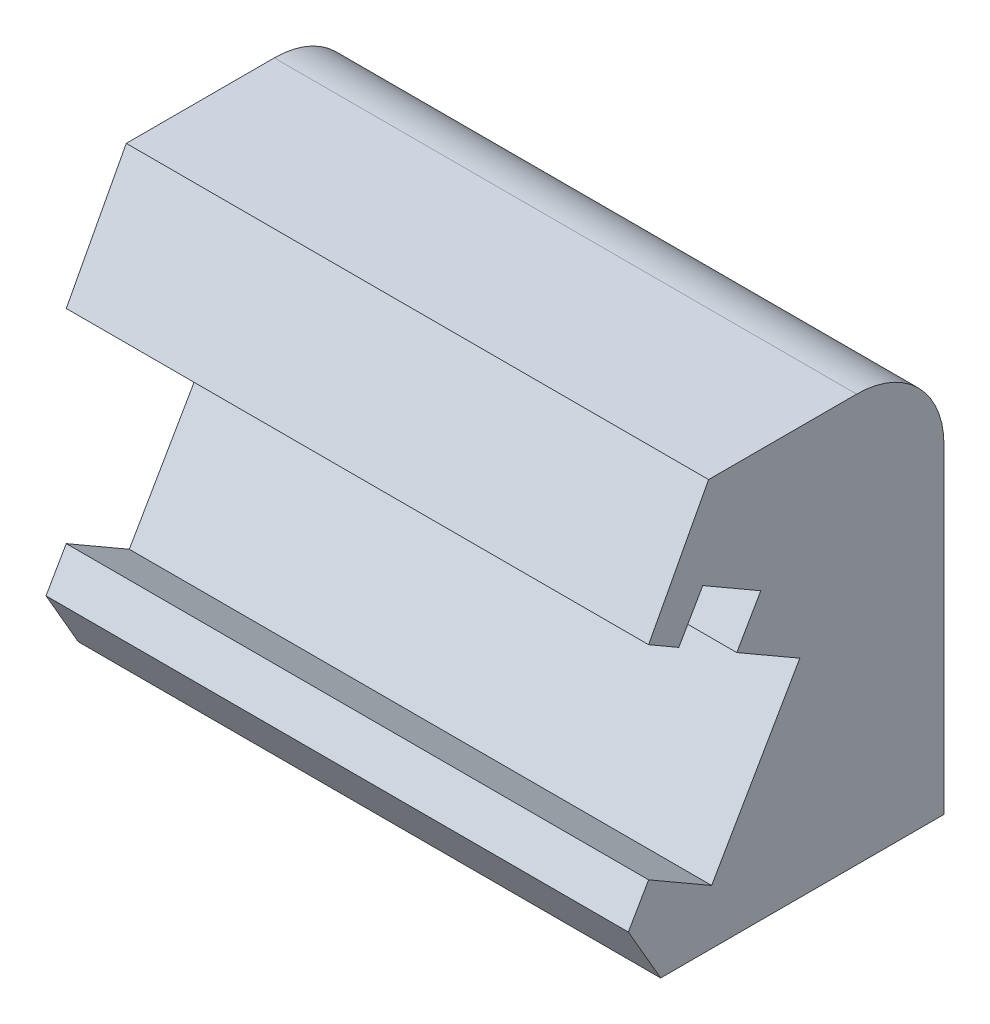
ISO-10303-21;
HEADER;
FILE_DESCRIPTION(('STEP AP214'),'2;1');
FILE_NAME('part.step','',(''),(''),'','','');
FILE_SCHEMA(('AUTOMOTIVE_DESIGN { 1 0 10303 214 1 1 1 1 }'));
ENDSEC;
DATA;
#1=APPLICATION_CONTEXT('core data for automotive mechanical design processes');
#2=APPLICATION_PROTOCOL_DEFINITION('international standard','automotive_design',2000,#1);
#3=PRODUCT_CONTEXT('',#1,'mechanical');
#4=PRODUCT('Part','Part','',(#3));
#5=PRODUCT_RELATED_PRODUCT_CATEGORY('part','',(#4));
#6=PRODUCT_DEFINITION_FORMATION('','',#4);
#7=PRODUCT_DEFINITION_CONTEXT('part definition',#1,'design');
#8=PRODUCT_DEFINITION('design','',#6,#7);
#9=PRODUCT_DEFINITION_SHAPE('','',#8);
#10=(LENGTH_UNIT() NAMED_UNIT(*) SI_UNIT(.MILLI.,.METRE.));
#11=(NAMED_UNIT(*) PLANE_ANGLE_UNIT() SI_UNIT($,.RADIAN.));
#12=(NAMED_UNIT(*) SI_UNIT($,.STERADIAN.) SOLID_ANGLE_UNIT());
#13=UNCERTAINTY_MEASURE_WITH_UNIT(LENGTH_MEASURE(1.E-05),#10,'distance_accuracy_value','');
#14=(GEOMETRIC_REPRESENTATION_CONTEXT(3) GLOBAL_UNCERTAINTY_ASSIGNED_CONTEXT((#13)) GLOBAL_UNIT_ASSIGNED_CONTEXT((#10,
#11,#12)) REPRESENTATION_CONTEXT('',''));
#15=CARTESIAN_POINT('',(0.,0.,0.));
#16=DIRECTION('',(0.,0.,1.));
#17=DIRECTION('',(1.,0.,0.));
#18=AXIS2_PLACEMENT_3D('',#15,#16,#17);
#19=CARTESIAN_POINT('',(-41.8,9.38,-6.7465234882107));
#20=DIRECTION('',(0.,-0.499999999999997,0.86602540378444));
#21=DIRECTION('',(0.,-0.86602540378444,-0.499999999999997));
#22=AXIS2_PLACEMENT_3D('',#19,#20,#21);
#23=PLANE('',#22);
#24=DIRECTION('',(0.,-0.86602540378444,-0.499999999999997));
#25=VECTOR('',#24,1.);
#26=CARTESIAN_POINT('',(-21.8,9.38,-6.7465234882107));
#27=LINE('',#26,#25);
#28=CARTESIAN_POINT('',(-21.8,11.3021331848201,-5.63677937653651));
#29=VERTEX_POINT('',#28);
#30=CARTESIAN_POINT('',(-21.8,9.38,-6.7465234882107));
#31=VERTEX_POINT('',#30);
#32=EDGE_CURVE('E221',#29,#31,#27,.T.);
#33=ORIENTED_EDGE('',*,*,#32,.F.);
#34=DIRECTION('',(-1.,0.,0.));
#35=VECTOR('',#34,1.);
#36=CARTESIAN_POINT('',(-21.8,11.3021331848201,-5.63677937653651));
#37=LINE('',#36,#35);
#38=CARTESIAN_POINT('',(-41.8,11.3021331848201,-5.63677937653651));
#39=VERTEX_POINT('',#38);
#40=EDGE_CURVE('E202',#29,#39,#37,.T.);
#41=ORIENTED_EDGE('',*,*,#40,.T.);
#42=DIRECTION('',(0.,-0.86602540378444,-0.499999999999997));
#43=VECTOR('',#42,1.);
#44=CARTESIAN_POINT('',(-41.8,9.38,-6.7465234882107));
#45=LINE('',#44,#43);
#46=CARTESIAN_POINT('',(-41.8,9.38,-6.7465234882107));
#47=VERTEX_POINT('',#46);
#48=EDGE_CURVE('E57',#39,#47,#45,.T.);
#49=ORIENTED_EDGE('',*,*,#48,.T.);
#50=DIRECTION('',(1.,0.,0.));
#51=VECTOR('',#50,1.);
#52=CARTESIAN_POINT('',(-41.8,9.38,-6.7465234882107));
#53=LINE('',#52,#51);
#54=EDGE_CURVE('E11',#47,#31,#53,.T.);
#55=ORIENTED_EDGE('',*,*,#54,.T.);
#56=EDGE_LOOP('',(#33,#41,#49,#55));
#57=FACE_BOUND('',#56,.T.);
#58=ADVANCED_FACE('F33',(#57),#23,.T.);
#59=CARTESIAN_POINT('',(-41.8,14.6021331848202,-3.73152348821072));
#60=DIRECTION('',(0.,0.4689519731062,0.88322366754962));
#61=DIRECTION('',(0.,-0.88322366754962,0.4689519731062));
#62=AXIS2_PLACEMENT_3D('',#59,#60,#61);
#63=PLANE('',#62);
#64=DIRECTION('',(0.,-0.88322366754962,0.4689519731062));
#65=VECTOR('',#64,1.);
#66=CARTESIAN_POINT('',(-41.8,14.6021331848202,-3.73152348821072));
#67=LINE('',#66,#65);
#68=CARTESIAN_POINT('',(-41.8,23.3813764402635,-8.3929061008864));
#69=VERTEX_POINT('',#68);
#70=CARTESIAN_POINT('',(-41.8,19.5005359644257,-6.33235466264919));
#71=VERTEX_POINT('',#70);
#72=EDGE_CURVE('E235',#69,#71,#67,.T.);
#73=ORIENTED_EDGE('',*,*,#72,.T.);
#74=DIRECTION('',(-1.,0.,0.));
#75=VECTOR('',#74,1.);
#76=CARTESIAN_POINT('',(-21.8,19.5005359644257,-6.3323546626492));
#77=LINE('',#76,#75);
#78=CARTESIAN_POINT('',(-21.8,19.5005359644257,-6.3323546626492));
#79=VERTEX_POINT('',#78);
#80=EDGE_CURVE('E204',#79,#71,#77,.T.);
#81=ORIENTED_EDGE('',*,*,#80,.F.);
#82=DIRECTION('',(0.,-0.88322366754962,0.4689519731062));
#83=VECTOR('',#82,1.);
#84=CARTESIAN_POINT('',(-21.8,14.6021331848202,-3.73152348821072));
#85=LINE('',#84,#83);
#86=CARTESIAN_POINT('',(-21.8,23.3813764402635,-8.3929061008864));
#87=VERTEX_POINT('',#86);
#88=EDGE_CURVE('E218',#87,#79,#85,.T.);
#89=ORIENTED_EDGE('',*,*,#88,.F.);
#90=DIRECTION('',(1.,0.,0.));
#91=VECTOR('',#90,1.);
#92=CARTESIAN_POINT('',(-41.8,23.3813764402635,-8.3929061008864));
#93=LINE('',#92,#91);
#94=EDGE_CURVE('E42',#69,#87,#93,.T.);
#95=ORIENTED_EDGE('',*,*,#94,.F.);
#96=EDGE_LOOP('',(#73,#81,#89,#95));
#97=FACE_BOUND('',#96,.T.);
#98=ADVANCED_FACE('F266',(#97),#63,.T.);
#99=CARTESIAN_POINT('',(-41.8,20.3813764402635,-13.4766045576977));
#100=DIRECTION('',(-1.,0.,0.));
#101=DIRECTION('',(0.,0.,1.));
#102=AXIS2_PLACEMENT_3D('',#99,#100,#101);
#103=PLANE('',#102);
#104=DIRECTION('',(0.,-0.866025403784438,0.500000000000001));
#105=VECTOR('',#104,1.);
#106=CARTESIAN_POINT('',(-41.8,18.9021282035334,-7.36882730815819));
#107=LINE('',#106,#105);
#108=CARTESIAN_POINT('',(-41.8,20.3288558380304,-8.19254889199526));
#109=VERTEX_POINT('',#108);
#110=CARTESIAN_POINT('',(-41.8,18.9021282035334,-7.36882730815819));
#111=VERTEX_POINT('',#110);
#112=EDGE_CURVE('E152',#109,#111,#107,.T.);
#113=ORIENTED_EDGE('',*,*,#112,.T.);
#114=DIRECTION('',(0.,0.499999999999999,0.866025403784439));
#115=VECTOR('',#114,1.);
#116=CARTESIAN_POINT('',(-41.8,19.5005359644257,-6.33235466264919));
#117=LINE('',#116,#115);
#118=EDGE_CURVE('E158',#111,#71,#117,.T.);
#119=ORIENTED_EDGE('',*,*,#118,.T.);
#120=ORIENTED_EDGE('',*,*,#72,.F.);
#121=DIRECTION('',(0.,0.,1.));
#122=VECTOR('',#121,1.);
#123=CARTESIAN_POINT('',(-41.8,23.3813764402635,-8.3929061008864));
#124=LINE('',#123,#122);
#125=CARTESIAN_POINT('',(-41.8,23.3813764402635,-13.4766045576977));
#126=VERTEX_POINT('',#125);
#127=EDGE_CURVE('E232',#126,#69,#124,.T.);
#128=ORIENTED_EDGE('',*,*,#127,.F.);
#129=CARTESIAN_POINT('',(-41.8,20.3813764402635,-13.4766045576977));
#130=DIRECTION('',(1.,0.,0.));
#131=DIRECTION('',(0.,0.,1.));
#132=AXIS2_PLACEMENT_3D('',#129,#130,#131);
#133=CIRCLE('',#132,3.);
#134=CARTESIAN_POINT('',(-41.8,20.3813764402635,-16.4766045576977));
#135=VERTEX_POINT('',#134);
#136=EDGE_CURVE('E229',#135,#126,#133,.T.);
#137=ORIENTED_EDGE('',*,*,#136,.F.);
#138=DIRECTION('',(0.,1.,0.));
#139=VECTOR('',#138,1.);
#140=CARTESIAN_POINT('',(-41.8,20.3813764402635,-16.4766045576977));
#141=LINE('',#140,#139);
#142=CARTESIAN_POINT('',(-41.8,9.38,-16.4766045576978));
#143=VERTEX_POINT('',#142);
#144=EDGE_CURVE('E226',#143,#135,#141,.T.);
#145=ORIENTED_EDGE('',*,*,#144,.F.);
#146=DIRECTION('',(0.,0.,-1.));
#147=VECTOR('',#146,1.);
#148=CARTESIAN_POINT('',(-41.8,9.38,-16.4766045576978));
#149=LINE('',#148,#147);
#150=EDGE_CURVE('E223',#47,#143,#149,.T.);
#151=ORIENTED_EDGE('',*,*,#150,.F.);
#152=ORIENTED_EDGE('',*,*,#48,.F.);
#153=DIRECTION('',(0.,0.86602540378444,-0.499999999999998));
#154=VECTOR('',#153,1.);
#155=CARTESIAN_POINT('',(-41.8,12.5069049208565,-6.33235466264919));
#156=LINE('',#155,#154);
#157=CARTESIAN_POINT('',(-41.8,12.5069049208565,-6.33235466264919));
#158=VERTEX_POINT('',#157);
#159=EDGE_CURVE('E166',#39,#158,#156,.T.);
#160=ORIENTED_EDGE('',*,*,#159,.T.);
#161=DIRECTION('',(0.,-0.499999999999999,-0.866025403784439));
#162=VECTOR('',#161,1.);
#163=CARTESIAN_POINT('',(-41.8,11.2569049208565,-8.4974181721103));
#164=LINE('',#163,#162);
#165=CARTESIAN_POINT('',(-41.8,11.2569049208565,-8.4974181721103));
#166=VERTEX_POINT('',#165);
#167=EDGE_CURVE('E169',#158,#166,#164,.T.);
#168=ORIENTED_EDGE('',*,*,#167,.T.);
#169=DIRECTION('',(0.,0.866025403784439,-0.5));
#170=VECTOR('',#169,1.);
#171=CARTESIAN_POINT('',(-41.8,16.5021282035334,-11.5257492463235));
#172=LINE('',#171,#170);
#173=CARTESIAN_POINT('',(-41.8,16.5021282035334,-11.5257492463235));
#174=VERTEX_POINT('',#173);
#175=EDGE_CURVE('E172',#166,#174,#172,.T.);
#176=ORIENTED_EDGE('',*,*,#175,.T.);
#177=DIRECTION('',(0.,0.499999999999999,0.866025403784439));
#178=VECTOR('',#177,1.);
#179=CARTESIAN_POINT('',(-41.8,17.7521282035334,-9.3606857368624));
#180=LINE('',#179,#178);
#181=CARTESIAN_POINT('',(-41.8,17.7521282035334,-9.3606857368624));
#182=VERTEX_POINT('',#181);
#183=EDGE_CURVE('E175',#174,#182,#180,.T.);
#184=ORIENTED_EDGE('',*,*,#183,.T.);
#185=DIRECTION('',(0.,0.86602540378444,-0.499999999999997));
#186=VECTOR('',#185,1.);
#187=CARTESIAN_POINT('',(-41.8,19.1788558380304,-10.1844073206995));
#188=LINE('',#187,#186);
#189=CARTESIAN_POINT('',(-41.8,19.1788558380304,-10.1844073206995));
#190=VERTEX_POINT('',#189);
#191=EDGE_CURVE('E162',#182,#190,#188,.T.);
#192=ORIENTED_EDGE('',*,*,#191,.T.);
#193=DIRECTION('',(0.,0.499999999999998,0.86602540378444));
#194=VECTOR('',#193,1.);
#195=CARTESIAN_POINT('',(-41.8,20.3288558380304,-8.19254889199526));
#196=LINE('',#195,#194);
#197=EDGE_CURVE('E142',#190,#109,#196,.T.);
#198=ORIENTED_EDGE('',*,*,#197,.T.);
#199=EDGE_LOOP('',(#113,#119,#120,#128,#137,#145,#151,#152,#160,#168,#176,#184,#192,#198));
#200=FACE_BOUND('',#199,.T.);
#201=ADVANCED_FACE('F160',(#200),#103,.T.);
#202=CARTESIAN_POINT('',(-21.8,20.3813764402635,-13.4766045576977));
#203=DIRECTION('',(-1.,0.,0.));
#204=DIRECTION('',(0.,0.,1.));
#205=AXIS2_PLACEMENT_3D('',#202,#203,#204);
#206=PLANE('',#205);
#207=DIRECTION('',(0.,0.499999999999999,0.866025403784439));
#208=VECTOR('',#207,1.);
#209=CARTESIAN_POINT('',(-21.8,19.5005359644257,-6.3323546626492));
#210=LINE('',#209,#208);
#211=CARTESIAN_POINT('',(-21.8,18.9021282035334,-7.36882730815819));
#212=VERTEX_POINT('',#211);
#213=EDGE_CURVE('E181',#212,#79,#210,.T.);
#214=ORIENTED_EDGE('',*,*,#213,.F.);
#215=DIRECTION('',(0.,-0.866025403784438,0.500000000000001));
#216=VECTOR('',#215,1.);
#217=CARTESIAN_POINT('',(-21.8,18.9021282035334,-7.36882730815819));
#218=LINE('',#217,#216);
#219=CARTESIAN_POINT('',(-21.8,20.3288558380304,-8.19254889199526));
#220=VERTEX_POINT('',#219);
#221=EDGE_CURVE('E179',#220,#212,#218,.T.);
#222=ORIENTED_EDGE('',*,*,#221,.F.);
#223=DIRECTION('',(0.,0.499999999999998,0.86602540378444));
#224=VECTOR('',#223,1.);
#225=CARTESIAN_POINT('',(-21.8,20.3288558380304,-8.19254889199526));
#226=LINE('',#225,#224);
#227=CARTESIAN_POINT('',(-21.8,19.1788558380304,-10.1844073206995));
#228=VERTEX_POINT('',#227);
#229=EDGE_CURVE('E145',#228,#220,#226,.T.);
#230=ORIENTED_EDGE('',*,*,#229,.F.);
#231=DIRECTION('',(0.,0.86602540378444,-0.499999999999997));
#232=VECTOR('',#231,1.);
#233=CARTESIAN_POINT('',(-21.8,19.1788558380304,-10.1844073206995));
#234=LINE('',#233,#232);
#235=CARTESIAN_POINT('',(-21.8,17.7521282035334,-9.3606857368624));
#236=VERTEX_POINT('',#235);
#237=EDGE_CURVE('E191',#236,#228,#234,.T.);
#238=ORIENTED_EDGE('',*,*,#237,.F.);
#239=DIRECTION('',(0.,0.499999999999999,0.866025403784439));
#240=VECTOR('',#239,1.);
#241=CARTESIAN_POINT('',(-21.8,17.7521282035334,-9.3606857368624));
#242=LINE('',#241,#240);
#243=CARTESIAN_POINT('',(-21.8,16.5021282035334,-11.5257492463235));
#244=VERTEX_POINT('',#243);
#245=EDGE_CURVE('E189',#244,#236,#242,.T.);
#246=ORIENTED_EDGE('',*,*,#245,.F.);
#247=DIRECTION('',(0.,0.866025403784439,-0.5));
#248=VECTOR('',#247,1.);
#249=CARTESIAN_POINT('',(-21.8,16.5021282035334,-11.5257492463235));
#250=LINE('',#249,#248);
#251=CARTESIAN_POINT('',(-21.8,11.2569049208565,-8.4974181721103));
#252=VERTEX_POINT('',#251);
#253=EDGE_CURVE('E187',#252,#244,#250,.T.);
#254=ORIENTED_EDGE('',*,*,#253,.F.);
#255=DIRECTION('',(0.,-0.499999999999999,-0.866025403784439));
#256=VECTOR('',#255,1.);
#257=CARTESIAN_POINT('',(-21.8,11.2569049208565,-8.4974181721103));
#258=LINE('',#257,#256);
#259=CARTESIAN_POINT('',(-21.8,12.5069049208565,-6.3323546626492));
#260=VERTEX_POINT('',#259);
#261=EDGE_CURVE('E185',#260,#252,#258,.T.);
#262=ORIENTED_EDGE('',*,*,#261,.F.);
#263=DIRECTION('',(0.,0.86602540378444,-0.499999999999998));
#264=VECTOR('',#263,1.);
#265=CARTESIAN_POINT('',(-21.8,12.5069049208565,-6.3323546626492));
#266=LINE('',#265,#264);
#267=EDGE_CURVE('E183',#29,#260,#266,.T.);
#268=ORIENTED_EDGE('',*,*,#267,.F.);
#269=ORIENTED_EDGE('',*,*,#32,.T.);
#270=DIRECTION('',(0.,0.,-1.));
#271=VECTOR('',#270,1.);
#272=CARTESIAN_POINT('',(-21.8,9.38,-16.4766045576978));
#273=LINE('',#272,#271);
#274=CARTESIAN_POINT('',(-21.8,9.38,-16.4766045576978));
#275=VERTEX_POINT('',#274);
#276=EDGE_CURVE('E148',#31,#275,#273,.T.);
#277=ORIENTED_EDGE('',*,*,#276,.T.);
#278=DIRECTION('',(0.,1.,0.));
#279=VECTOR('',#278,1.);
#280=CARTESIAN_POINT('',(-21.8,20.3813764402635,-16.4766045576977));
#281=LINE('',#280,#279);
#282=CARTESIAN_POINT('',(-21.8,20.3813764402635,-16.4766045576977));
#283=VERTEX_POINT('',#282);
#284=EDGE_CURVE('E209',#275,#283,#281,.T.);
#285=ORIENTED_EDGE('',*,*,#284,.T.);
#286=CARTESIAN_POINT('',(-21.8,20.3813764402635,-13.4766045576977));
#287=DIRECTION('',(1.,0.,0.));
#288=DIRECTION('',(0.,0.,1.));
#289=AXIS2_PLACEMENT_3D('',#286,#287,#288);
#290=CIRCLE('',#289,3.);
#291=CARTESIAN_POINT('',(-21.8,23.3813764402635,-13.4766045576977));
#292=VERTEX_POINT('',#291);
#293=EDGE_CURVE('E212',#283,#292,#290,.T.);
#294=ORIENTED_EDGE('',*,*,#293,.T.);
#295=DIRECTION('',(0.,0.,1.));
#296=VECTOR('',#295,1.);
#297=CARTESIAN_POINT('',(-21.8,23.3813764402635,-8.3929061008864));
#298=LINE('',#297,#296);
#299=EDGE_CURVE('E215',#292,#87,#298,.T.);
#300=ORIENTED_EDGE('',*,*,#299,.T.);
#301=ORIENTED_EDGE('',*,*,#88,.T.);
#302=EDGE_LOOP('',(#214,#222,#230,#238,#246,#254,#262,#268,#269,#277,#285,#294,#300,#301));
#303=FACE_BOUND('',#302,.T.);
#304=ADVANCED_FACE('F252',(#303),#206,.F.);
#305=CARTESIAN_POINT('',(-41.8,9.38,-16.4766045576978));
#306=DIRECTION('',(0.,-1.,0.));
#307=DIRECTION('',(0.,0.,-1.));
#308=AXIS2_PLACEMENT_3D('',#305,#306,#307);
#309=PLANE('',#308);
#310=DIRECTION('',(1.,0.,0.));
#311=VECTOR('',#310,1.);
#312=CARTESIAN_POINT('',(-41.8,9.38,-16.4766045576978));
#313=LINE('',#312,#311);
#314=EDGE_CURVE('E37',#143,#275,#313,.T.);
#315=ORIENTED_EDGE('',*,*,#314,.T.);
#316=ORIENTED_EDGE('',*,*,#276,.F.);
#317=ORIENTED_EDGE('',*,*,#54,.F.);
#318=ORIENTED_EDGE('',*,*,#150,.T.);
#319=EDGE_LOOP('',(#315,#316,#317,#318));
#320=FACE_BOUND('',#319,.T.);
#321=ADVANCED_FACE('F35',(#320),#309,.T.);
#322=CARTESIAN_POINT('',(-41.8,23.3813764402635,-8.3929061008864));
#323=DIRECTION('',(0.,1.,0.));
#324=DIRECTION('',(0.,0.,1.));
#325=AXIS2_PLACEMENT_3D('',#322,#323,#324);
#326=PLANE('',#325);
#327=ORIENTED_EDGE('',*,*,#94,.T.);
#328=ORIENTED_EDGE('',*,*,#299,.F.);
#329=DIRECTION('',(1.,0.,0.));
#330=VECTOR('',#329,1.);
#331=CARTESIAN_POINT('',(-41.8,23.3813764402635,-13.4766045576977));
#332=LINE('',#331,#330);
#333=EDGE_CURVE('E240',#126,#292,#332,.T.);
#334=ORIENTED_EDGE('',*,*,#333,.F.);
#335=ORIENTED_EDGE('',*,*,#127,.T.);
#336=EDGE_LOOP('',(#327,#328,#334,#335));
#337=FACE_BOUND('',#336,.T.);
#338=ADVANCED_FACE('F264',(#337),#326,.T.);
#339=CARTESIAN_POINT('',(-41.8,20.3813764402635,-13.4766045576977));
#340=DIRECTION('',(1.,0.,0.));
#341=DIRECTION('',(0.,0.,-1.));
#342=AXIS2_PLACEMENT_3D('',#339,#340,#341);
#343=CYLINDRICAL_SURFACE('',#342,3.);
#344=ORIENTED_EDGE('',*,*,#333,.T.);
#345=ORIENTED_EDGE('',*,*,#293,.F.);
#346=DIRECTION('',(1.,0.,0.));
#347=VECTOR('',#346,1.);
#348=CARTESIAN_POINT('',(-41.8,20.3813764402635,-16.4766045576977));
#349=LINE('',#348,#347);
#350=EDGE_CURVE('E241',#135,#283,#349,.T.);
#351=ORIENTED_EDGE('',*,*,#350,.F.);
#352=ORIENTED_EDGE('',*,*,#136,.T.);
#353=EDGE_LOOP('',(#344,#345,#351,#352));
#354=FACE_BOUND('',#353,.T.);
#355=ADVANCED_FACE('F260',(#354),#343,.T.);
#356=CARTESIAN_POINT('',(-41.8,20.3813764402635,-16.4766045576977));
#357=DIRECTION('',(0.,0.,-1.));
#358=DIRECTION('',(0.,1.,0.));
#359=AXIS2_PLACEMENT_3D('',#356,#357,#358);
#360=PLANE('',#359);
#361=ORIENTED_EDGE('',*,*,#350,.T.);
#362=ORIENTED_EDGE('',*,*,#284,.F.);
#363=ORIENTED_EDGE('',*,*,#314,.F.);
#364=ORIENTED_EDGE('',*,*,#144,.T.);
#365=EDGE_LOOP('',(#361,#362,#363,#364));
#366=FACE_BOUND('',#365,.T.);
#367=ADVANCED_FACE('F248',(#366),#360,.T.);
#368=CARTESIAN_POINT('',(-21.8,20.3288558380304,-8.19254889199526));
#369=DIRECTION('',(0.,-0.86602540378444,0.499999999999998));
#370=DIRECTION('',(0.,-0.499999999999998,-0.86602540378444));
#371=AXIS2_PLACEMENT_3D('',#368,#369,#370);
#372=PLANE('',#371);
#373=DIRECTION('',(-1.,0.,0.));
#374=VECTOR('',#373,1.);
#375=CARTESIAN_POINT('',(-21.8,19.1788558380304,-10.1844073206995));
#376=LINE('',#375,#374);
#377=EDGE_CURVE('E193',#228,#190,#376,.T.);
#378=ORIENTED_EDGE('',*,*,#377,.F.);
#379=ORIENTED_EDGE('',*,*,#229,.T.);
#380=DIRECTION('',(-1.,0.,0.));
#381=VECTOR('',#380,1.);
#382=CARTESIAN_POINT('',(-21.8,20.3288558380304,-8.19254889199526));
#383=LINE('',#382,#381);
#384=EDGE_CURVE('E137',#220,#109,#383,.T.);
#385=ORIENTED_EDGE('',*,*,#384,.T.);
#386=ORIENTED_EDGE('',*,*,#197,.F.);
#387=EDGE_LOOP('',(#378,#379,#385,#386));
#388=FACE_BOUND('',#387,.T.);
#389=ADVANCED_FACE('F140',(#388),#372,.T.);
#390=CARTESIAN_POINT('',(-21.8,18.9021282035334,-7.36882730815819));
#391=DIRECTION('',(0.,-0.500000000000001,-0.866025403784438));
#392=DIRECTION('',(0.,0.866025403784438,-0.500000000000001));
#393=AXIS2_PLACEMENT_3D('',#390,#391,#392);
#394=PLANE('',#393);
#395=ORIENTED_EDGE('',*,*,#384,.F.);
#396=ORIENTED_EDGE('',*,*,#221,.T.);
#397=DIRECTION('',(-1.,0.,0.));
#398=VECTOR('',#397,1.);
#399=CARTESIAN_POINT('',(-21.8,18.9021282035334,-7.36882730815819));
#400=LINE('',#399,#398);
#401=EDGE_CURVE('E149',#212,#111,#400,.T.);
#402=ORIENTED_EDGE('',*,*,#401,.T.);
#403=ORIENTED_EDGE('',*,*,#112,.F.);
#404=EDGE_LOOP('',(#395,#396,#402,#403));
#405=FACE_BOUND('',#404,.T.);
#406=ADVANCED_FACE('F153',(#405),#394,.T.);
#407=CARTESIAN_POINT('',(-21.8,19.5005359644257,-6.3323546626492));
#408=DIRECTION('',(0.,-0.866025403784439,0.499999999999999));
#409=DIRECTION('',(0.,-0.499999999999999,-0.866025403784439));
#410=AXIS2_PLACEMENT_3D('',#407,#408,#409);
#411=PLANE('',#410);
#412=ORIENTED_EDGE('',*,*,#401,.F.);
#413=ORIENTED_EDGE('',*,*,#213,.T.);
#414=ORIENTED_EDGE('',*,*,#80,.T.);
#415=ORIENTED_EDGE('',*,*,#118,.F.);
#416=EDGE_LOOP('',(#412,#413,#414,#415));
#417=FACE_BOUND('',#416,.T.);
#418=ADVANCED_FACE('F269',(#417),#411,.T.);
#419=CARTESIAN_POINT('',(-21.8,12.5069049208565,-6.3323546626492));
#420=DIRECTION('',(0.,0.499999999999998,0.86602540378444));
#421=DIRECTION('',(0.,-0.86602540378444,0.499999999999998));
#422=AXIS2_PLACEMENT_3D('',#419,#420,#421);
#423=PLANE('',#422);
#424=ORIENTED_EDGE('',*,*,#40,.F.);
#425=ORIENTED_EDGE('',*,*,#267,.T.);
#426=DIRECTION('',(-1.,0.,0.));
#427=VECTOR('',#426,1.);
#428=CARTESIAN_POINT('',(-21.8,12.5069049208565,-6.3323546626492));
#429=LINE('',#428,#427);
#430=EDGE_CURVE('E200',#260,#158,#429,.T.);
#431=ORIENTED_EDGE('',*,*,#430,.T.);
#432=ORIENTED_EDGE('',*,*,#159,.F.);
#433=EDGE_LOOP('',(#424,#425,#431,#432));
#434=FACE_BOUND('',#433,.T.);
#435=ADVANCED_FACE('F287',(#434),#423,.T.);
#436=CARTESIAN_POINT('',(-21.8,11.2569049208565,-8.4974181721103));
#437=DIRECTION('',(0.,0.866025403784439,-0.499999999999999));
#438=DIRECTION('',(0.,0.499999999999999,0.866025403784439));
#439=AXIS2_PLACEMENT_3D('',#436,#437,#438);
#440=PLANE('',#439);
#441=ORIENTED_EDGE('',*,*,#430,.F.);
#442=ORIENTED_EDGE('',*,*,#261,.T.);
#443=DIRECTION('',(-1.,0.,0.));
#444=VECTOR('',#443,1.);
#445=CARTESIAN_POINT('',(-21.8,11.2569049208565,-8.4974181721103));
#446=LINE('',#445,#444);
#447=EDGE_CURVE('E198',#252,#166,#446,.T.);
#448=ORIENTED_EDGE('',*,*,#447,.T.);
#449=ORIENTED_EDGE('',*,*,#167,.F.);
#450=EDGE_LOOP('',(#441,#442,#448,#449));
#451=FACE_BOUND('',#450,.T.);
#452=ADVANCED_FACE('F284',(#451),#440,.T.);
#453=CARTESIAN_POINT('',(-21.8,16.5021282035334,-11.5257492463235));
#454=DIRECTION('',(0.,0.5,0.866025403784439));
#455=DIRECTION('',(0.,-0.866025403784439,0.5));
#456=AXIS2_PLACEMENT_3D('',#453,#454,#455);
#457=PLANE('',#456);
#458=ORIENTED_EDGE('',*,*,#447,.F.);
#459=ORIENTED_EDGE('',*,*,#253,.T.);
#460=DIRECTION('',(-1.,0.,0.));
#461=VECTOR('',#460,1.);
#462=CARTESIAN_POINT('',(-21.8,16.5021282035334,-11.5257492463235));
#463=LINE('',#462,#461);
#464=EDGE_CURVE('E196',#244,#174,#463,.T.);
#465=ORIENTED_EDGE('',*,*,#464,.T.);
#466=ORIENTED_EDGE('',*,*,#175,.F.);
#467=EDGE_LOOP('',(#458,#459,#465,#466));
#468=FACE_BOUND('',#467,.T.);
#469=ADVANCED_FACE('F281',(#468),#457,.T.);
#470=CARTESIAN_POINT('',(-21.8,17.7521282035334,-9.3606857368624));
#471=DIRECTION('',(0.,-0.866025403784439,0.499999999999999));
#472=DIRECTION('',(0.,-0.499999999999999,-0.866025403784439));
#473=AXIS2_PLACEMENT_3D('',#470,#471,#472);
#474=PLANE('',#473);
#475=ORIENTED_EDGE('',*,*,#464,.F.);
#476=ORIENTED_EDGE('',*,*,#245,.T.);
#477=DIRECTION('',(-1.,0.,0.));
#478=VECTOR('',#477,1.);
#479=CARTESIAN_POINT('',(-21.8,17.7521282035334,-9.3606857368624));
#480=LINE('',#479,#478);
#481=EDGE_CURVE('E50',#236,#182,#480,.T.);
#482=ORIENTED_EDGE('',*,*,#481,.T.);
#483=ORIENTED_EDGE('',*,*,#183,.F.);
#484=EDGE_LOOP('',(#475,#476,#482,#483));
#485=FACE_BOUND('',#484,.T.);
#486=ADVANCED_FACE('F278',(#485),#474,.T.);
#487=CARTESIAN_POINT('',(-21.8,19.1788558380304,-10.1844073206995));
#488=DIRECTION('',(0.,0.499999999999997,0.86602540378444));
#489=DIRECTION('',(0.,-0.86602540378444,0.499999999999998));
#490=AXIS2_PLACEMENT_3D('',#487,#488,#489);
#491=PLANE('',#490);
#492=ORIENTED_EDGE('',*,*,#481,.F.);
#493=ORIENTED_EDGE('',*,*,#237,.T.);
#494=ORIENTED_EDGE('',*,*,#377,.T.);
#495=ORIENTED_EDGE('',*,*,#191,.F.);
#496=EDGE_LOOP('',(#492,#493,#494,#495));
#497=FACE_BOUND('',#496,.T.);
#498=ADVANCED_FACE('F273',(#497),#491,.T.);
#499=CLOSED_SHELL('',(#58,#98,#201,#304,#321,#338,#355,#367,#389,#406,#418,#435,#452,#469,#486,#498));
#500=MANIFOLD_SOLID_BREP('B2',#499);
#501=ADVANCED_BREP_SHAPE_REPRESENTATION('',(#18,#500),#14);
#502=SHAPE_DEFINITION_REPRESENTATION(#9,#501);
ENDSEC;
END-ISO-10303-21;
